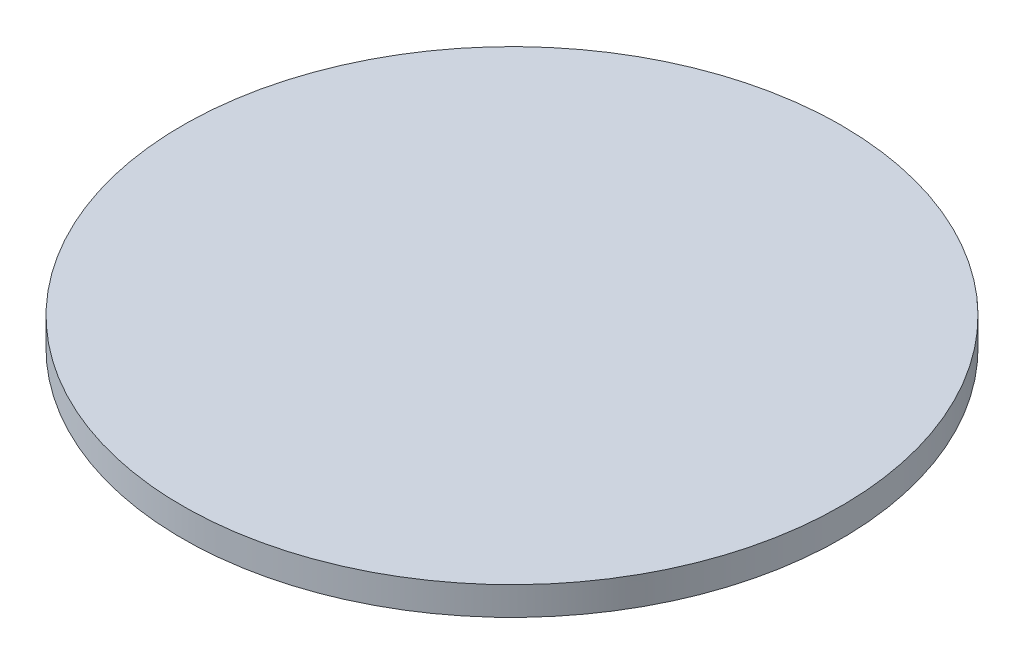
ISO-10303-21;
HEADER;
FILE_DESCRIPTION(('STEP AP214'),'2;1');
FILE_NAME('part.step','',(''),(''),'','','');
FILE_SCHEMA(('AUTOMOTIVE_DESIGN { 1 0 10303 214 1 1 1 1 }'));
ENDSEC;
DATA;
#1=APPLICATION_CONTEXT('core data for automotive mechanical design processes');
#2=APPLICATION_PROTOCOL_DEFINITION('international standard','automotive_design',2000,#1);
#3=PRODUCT_CONTEXT('',#1,'mechanical');
#4=PRODUCT('Part','Part','',(#3));
#5=PRODUCT_RELATED_PRODUCT_CATEGORY('part','',(#4));
#6=PRODUCT_DEFINITION_FORMATION('','',#4);
#7=PRODUCT_DEFINITION_CONTEXT('part definition',#1,'design');
#8=PRODUCT_DEFINITION('design','',#6,#7);
#9=PRODUCT_DEFINITION_SHAPE('','',#8);
#10=(LENGTH_UNIT() NAMED_UNIT(*) SI_UNIT(.MILLI.,.METRE.));
#11=(NAMED_UNIT(*) PLANE_ANGLE_UNIT() SI_UNIT($,.RADIAN.));
#12=(NAMED_UNIT(*) SI_UNIT($,.STERADIAN.) SOLID_ANGLE_UNIT());
#13=UNCERTAINTY_MEASURE_WITH_UNIT(LENGTH_MEASURE(1.E-05),#10,'distance_accuracy_value','');
#14=(GEOMETRIC_REPRESENTATION_CONTEXT(3) GLOBAL_UNCERTAINTY_ASSIGNED_CONTEXT((#13)) GLOBAL_UNIT_ASSIGNED_CONTEXT((#10,
#11,#12)) REPRESENTATION_CONTEXT('',''));
#15=CARTESIAN_POINT('',(0.,0.,0.));
#16=DIRECTION('',(0.,0.,1.));
#17=DIRECTION('',(1.,0.,0.));
#18=AXIS2_PLACEMENT_3D('',#15,#16,#17);
#19=CARTESIAN_POINT('',(280.194091823704,490.812576349493,565.187541491486));
#20=CARTESIAN_POINT('',(276.898103196784,490.812576349493,565.187541491486));
#21=CARTESIAN_POINT('',(270.306125942945,490.812576349493,565.511384567719));
#22=CARTESIAN_POINT('',(260.51338657893,490.812576349493,566.964000231986));
#23=CARTESIAN_POINT('',(250.91018316499,490.812576349493,569.369477463242));
#24=CARTESIAN_POINT('',(241.588999799647,490.812576349493,572.704650200784));
#25=CARTESIAN_POINT('',(232.639604574185,490.812576349493,576.937398907958));
#26=CARTESIAN_POINT('',(224.148185056863,490.812576349493,582.026959900857));
#27=CARTESIAN_POINT('',(216.196518259514,490.812576349493,587.924317924883));
#28=CARTESIAN_POINT('',(208.861183080222,490.812576349493,594.572678198442));
#29=CARTESIAN_POINT('',(202.212822806663,490.812576349493,601.908013377735));
#30=CARTESIAN_POINT('',(196.315464782636,490.812576349493,609.859680175083));
#31=CARTESIAN_POINT('',(191.225903789737,490.812576349493,618.351099692405));
#32=CARTESIAN_POINT('',(186.993155082564,490.812576349493,627.300494917867));
#33=CARTESIAN_POINT('',(183.657982345022,490.812576349493,636.62167828321));
#34=CARTESIAN_POINT('',(181.252505113766,490.812576349493,646.22488169715));
#35=CARTESIAN_POINT('',(179.799889449499,490.812576349493,656.017621061165));
#36=CARTESIAN_POINT('',(179.314124835149,490.812576349493,665.905586941924));
#37=CARTESIAN_POINT('',(179.799889449499,490.812576349493,675.793552822682));
#38=CARTESIAN_POINT('',(181.252505113765,490.812576349493,685.586292186697));
#39=CARTESIAN_POINT('',(183.657982345022,490.812576349493,695.189495600637));
#40=CARTESIAN_POINT('',(186.993155082564,490.812576349493,704.510678965981));
#41=CARTESIAN_POINT('',(191.225903789737,490.812576349493,713.460074191443));
#42=CARTESIAN_POINT('',(196.315464782637,490.812576349493,721.951493708765));
#43=CARTESIAN_POINT('',(202.212822806663,490.812576349493,729.903160506113));
#44=CARTESIAN_POINT('',(208.861183080222,490.812576349493,737.238495685406));
#45=CARTESIAN_POINT('',(216.196518259514,490.812576349493,743.886855958964));
#46=CARTESIAN_POINT('',(224.148185056863,490.812576349493,749.784213982991));
#47=CARTESIAN_POINT('',(232.639604574185,490.812576349493,754.87377497589));
#48=CARTESIAN_POINT('',(241.588999799647,490.812576349493,759.106523683064));
#49=CARTESIAN_POINT('',(250.91018316499,490.812576349493,762.441696420605));
#50=CARTESIAN_POINT('',(260.51338657893,490.812576349493,764.847173651862));
#51=CARTESIAN_POINT('',(270.306125942945,490.812576349493,766.299789316129));
#52=CARTESIAN_POINT('',(280.194091823704,490.812576349493,766.785553930478));
#53=CARTESIAN_POINT('',(290.082057704462,490.812576349493,766.299789316129));
#54=CARTESIAN_POINT('',(299.874797068477,490.812576349493,764.847173651862));
#55=CARTESIAN_POINT('',(309.478000482417,490.812576349493,762.441696420605));
#56=CARTESIAN_POINT('',(318.799183847761,490.812576349493,759.106523683064));
#57=CARTESIAN_POINT('',(327.748579073222,490.812576349493,754.87377497589));
#58=CARTESIAN_POINT('',(336.239998590545,490.812576349493,749.784213982991));
#59=CARTESIAN_POINT('',(344.191665387893,490.812576349493,743.886855958964));
#60=CARTESIAN_POINT('',(351.527000567185,490.812576349493,737.238495685406));
#61=CARTESIAN_POINT('',(358.175360840744,490.812576349493,729.903160506113));
#62=CARTESIAN_POINT('',(364.072718864771,490.812576349493,721.951493708765));
#63=CARTESIAN_POINT('',(369.16227985767,490.812576349493,713.460074191443));
#64=CARTESIAN_POINT('',(373.395028564843,490.812576349493,704.510678965981));
#65=CARTESIAN_POINT('',(376.730201302385,490.812576349492,695.189495600637));
#66=CARTESIAN_POINT('',(379.135678533642,490.812576349493,685.586292186698));
#67=CARTESIAN_POINT('',(380.588294197909,490.812576349493,675.793552822682));
#68=CARTESIAN_POINT('',(381.074058812258,490.812576349493,665.905586941924));
#69=CARTESIAN_POINT('',(380.588294197908,490.812576349493,656.017621061165));
#70=CARTESIAN_POINT('',(379.135678533642,490.812576349493,646.22488169715));
#71=CARTESIAN_POINT('',(376.730201302385,490.812576349493,636.62167828321));
#72=CARTESIAN_POINT('',(373.395028564843,490.812576349493,627.300494917867));
#73=CARTESIAN_POINT('',(369.16227985767,490.812576349493,618.351099692405));
#74=CARTESIAN_POINT('',(364.072718864771,490.812576349493,609.859680175083));
#75=CARTESIAN_POINT('',(358.175360840744,490.812576349493,601.908013377735));
#76=CARTESIAN_POINT('',(351.527000567186,490.812576349493,594.572678198442));
#77=CARTESIAN_POINT('',(344.191665387893,490.812576349492,587.924317924883));
#78=CARTESIAN_POINT('',(336.239998590545,490.812576349493,582.026959900857));
#79=CARTESIAN_POINT('',(327.748579073223,490.812576349493,576.937398907957));
#80=CARTESIAN_POINT('',(318.799183847761,490.812576349493,572.704650200784));
#81=CARTESIAN_POINT('',(309.478000482417,490.812576349493,569.369477463242));
#82=CARTESIAN_POINT('',(299.874797068477,490.812576349493,566.964000231986));
#83=CARTESIAN_POINT('',(290.082057704462,490.812576349493,565.511384567719));
#84=CARTESIAN_POINT('',(283.490080450623,490.812576349493,565.187541491486));
#85=CARTESIAN_POINT('',(280.194091823704,490.812576349493,565.187541491486));
#86=B_SPLINE_CURVE_WITH_KNOTS('',3,(#19,#20,#21,#22,#23,#24,#25,#26,#27,#28,#29,#30,#31,#32,#33,
#34,#35,#36,#37,#38,#39,#40,#41,#42,#43,#44,#45,#46,#47,#48,#49,#50,#51,#52,#53,#54,#55,#56,#57,
#58,#59,#60,#61,#62,#63,#64,#65,#66,#67,#68,#69,#70,#71,#72,#73,#74,#75,#76,#77,#78,#79,#80,#81,
#82,#83,#84,#85),.UNSPECIFIED.,.T.,.F.,(4,1,1,1,1,1,1,1,1,1,1,1,1,1,1,1,1,1,1,1,1,1,1,1,1,1,1,1,
1,1,1,1,1,1,1,1,1,1,1,1,1,1,1,1,1,1,1,1,1,1,1,1,1,1,1,1,1,1,1,1,1,1,1,1,4),(0.,0.015625,0.03125,
0.046875,0.0625,0.078125,0.09375,0.109375,0.125,0.140625,0.15625,0.171875,0.1875,0.203125,
0.21875,0.234375,0.25,0.265625,0.28125,0.296875,0.3125,0.328125,0.34375,0.359375,0.375,0.390625,
0.40625,0.421875,0.4375,0.453125,0.46875,0.484375,0.5,0.515625,0.53125,0.546875,0.5625,0.578125,
0.59375,0.609375,0.625,0.640625,0.65625,0.671875,0.6875,0.703125,0.71875,0.734375,0.75,0.765625,
0.78125,0.796875,0.8125,0.828125,0.84375,0.859375,0.875,0.890625,0.90625,0.921875,0.9375,
0.953125,0.96875,0.984375,1.),.UNSPECIFIED.);
#87=DIRECTION('',(0.,-1.,0.));
#88=VECTOR('',#87,1.);
#89=SURFACE_OF_LINEAR_EXTRUSION('',#86,#88);
#90=CARTESIAN_POINT('',(280.194091823704,490.812576349493,565.187541491486));
#91=CARTESIAN_POINT('',(281.842086137163,490.812576349493,565.187541491486));
#92=CARTESIAN_POINT('',(283.490080450623,490.812576349493,565.228021876015));
#93=CARTESIAN_POINT('',(286.782101306012,490.812576349493,565.389748490016));
#94=CARTESIAN_POINT('',(288.42612784794,490.812576349493,565.510994719487));
#95=CARTESIAN_POINT('',(291.706245388736,490.812576349493,565.834058099256));
#96=CARTESIAN_POINT('',(293.342336387603,490.812576349493,566.035875249554));
#97=CARTESIAN_POINT('',(296.602653282552,490.812576349493,566.519497575855));
#98=CARTESIAN_POINT('',(298.226879178635,490.812576349493,566.801302751857));
#99=CARTESIAN_POINT('',(301.459536308294,490.812576349493,567.444318234444));
#100=CARTESIAN_POINT('',(303.067967541871,490.812576349492,567.805528541029));
#101=CARTESIAN_POINT('',(306.265181842412,490.812576349493,568.606389032252));
#102=CARTESIAN_POINT('',(307.853964909377,490.812576349493,569.04603921689));
#103=CARTESIAN_POINT('',(311.008029372591,490.812576349493,570.00281421169));
#104=CARTESIAN_POINT('',(312.57331076884,490.812576349493,570.519939021852));
#105=CARTESIAN_POINT('',(315.676631553484,490.812576349492,571.630324953671));
#106=CARTESIAN_POINT('',(317.21467094188,490.812576349493,572.22358607533));
#107=CARTESIAN_POINT('',(320.259767373681,490.812576349493,573.484906316116));
#108=CARTESIAN_POINT('',(321.766824417086,490.812576349493,574.152965435243));
#109=CARTESIAN_POINT('',(324.746365010229,490.812576349493,575.562183184138));
#110=CARTESIAN_POINT('',(326.218848559967,490.812576349493,576.303341813906));
#111=CARTESIAN_POINT('',(329.125651017098,490.812576349493,577.857060097251));
#112=CARTESIAN_POINT('',(330.559969924491,490.812576349493,578.669619750829));
#113=CARTESIAN_POINT('',(333.387035721439,490.812576349493,580.364097779521));
#114=CARTESIAN_POINT('',(334.779782610993,490.812576349493,581.246016154634));
#115=CARTESIAN_POINT('',(337.520296996772,490.812576349493,583.077169324122));
#116=CARTESIAN_POINT('',(338.868064492995,490.812576349493,584.026404118496));
#117=CARTESIAN_POINT('',(341.515429304691,490.812576349493,585.989823677272));
#118=CARTESIAN_POINT('',(342.815026620164,490.812576349493,587.004008441673));
#119=CARTESIAN_POINT('',(345.362860282937,490.812576349493,589.094961491271));
#120=CARTESIAN_POINT('',(346.611096630238,490.812576349493,590.171729776467));
#121=CARTESIAN_POINT('',(349.053264886349,490.812576349493,592.385182061661));
#122=CARTESIAN_POINT('',(350.247196795159,490.812576349493,593.52186606166));
#123=CARTESIAN_POINT('',(352.577812703968,490.812576349493,595.852481970469));
#124=CARTESIAN_POINT('',(353.714496703966,490.812576349493,597.046413879279));
#125=CARTESIAN_POINT('',(355.927948989161,490.812576349493,599.48858213539));
#126=CARTESIAN_POINT('',(357.004717274357,490.812576349493,600.736818482691));
#127=CARTESIAN_POINT('',(359.095670323954,490.812576349493,603.284652145464));
#128=CARTESIAN_POINT('',(360.109855088356,490.812576349493,604.584249460936));
#129=CARTESIAN_POINT('',(362.073274647132,490.812576349492,607.231614272632));
#130=CARTESIAN_POINT('',(363.022509441506,490.812576349492,608.579381768856));
#131=CARTESIAN_POINT('',(364.853662610993,490.812576349493,611.319896154634));
#132=CARTESIAN_POINT('',(365.735580986107,490.812576349493,612.712643044189));
#133=CARTESIAN_POINT('',(367.430059014798,490.812576349493,615.539708841137));
#134=CARTESIAN_POINT('',(368.242618668376,490.812576349493,616.97402774853));
#135=CARTESIAN_POINT('',(369.796336951722,490.812576349493,619.88083020566));
#136=CARTESIAN_POINT('',(370.537495581489,490.812576349493,621.353313755398));
#137=CARTESIAN_POINT('',(371.946713330384,490.812576349493,624.332854348541));
#138=CARTESIAN_POINT('',(372.614772449512,490.812576349493,625.839911391947));
#139=CARTESIAN_POINT('',(373.876092690298,490.812576349493,628.885007823748));
#140=CARTESIAN_POINT('',(374.469353811956,490.812576349493,630.423047212143));
#141=CARTESIAN_POINT('',(375.579739743776,490.812576349493,633.526367996788));
#142=CARTESIAN_POINT('',(376.096864553938,490.812576349493,635.091649393036));
#143=CARTESIAN_POINT('',(377.053639548737,490.812576349493,638.24571385625));
#144=CARTESIAN_POINT('',(377.493289733375,490.812576349493,639.834496923215));
#145=CARTESIAN_POINT('',(378.294150224598,490.812576349493,643.031711223757));
#146=CARTESIAN_POINT('',(378.655360531183,490.812576349493,644.640142457333));
#147=CARTESIAN_POINT('',(379.29837601377,490.812576349493,647.872799586993));
#148=CARTESIAN_POINT('',(379.580181189773,490.812576349493,649.497025483075));
#149=CARTESIAN_POINT('',(380.063803516073,490.812576349493,652.757342378025));
#150=CARTESIAN_POINT('',(380.265620666371,490.812576349493,654.393433376891));
#151=CARTESIAN_POINT('',(380.58868404614,490.812576349493,657.673550917687));
#152=CARTESIAN_POINT('',(380.709930275612,490.812576349493,659.317577459616));
#153=CARTESIAN_POINT('',(380.871656889612,490.812576349493,662.609598315004));
#154=CARTESIAN_POINT('',(380.912137274142,490.812576349493,664.257592628464));
#155=CARTESIAN_POINT('',(380.912137274142,490.812576349493,667.553581255384));
#156=CARTESIAN_POINT('',(380.871656889612,490.812576349493,669.201575568844));
#157=CARTESIAN_POINT('',(380.709930275612,490.812576349493,672.493596424232));
#158=CARTESIAN_POINT('',(380.58868404614,490.812576349493,674.137622966161));
#159=CARTESIAN_POINT('',(380.265620666371,490.812576349493,677.417740506956));
#160=CARTESIAN_POINT('',(380.063803516073,490.812576349493,679.053831505823));
#161=CARTESIAN_POINT('',(379.580181189773,490.812576349493,682.314148400773));
#162=CARTESIAN_POINT('',(379.29837601377,490.812576349493,683.938374296855));
#163=CARTESIAN_POINT('',(378.655360531183,490.812576349493,687.171031426515));
#164=CARTESIAN_POINT('',(378.294150224598,490.812576349493,688.779462660091));
#165=CARTESIAN_POINT('',(377.493289733375,490.812576349492,691.976676960633));
#166=CARTESIAN_POINT('',(377.053639548737,490.812576349492,693.565460027598));
#167=CARTESIAN_POINT('',(376.096864553938,490.812576349492,696.719524490812));
#168=CARTESIAN_POINT('',(375.579739743776,490.812576349492,698.28480588706));
#169=CARTESIAN_POINT('',(374.469353811956,490.812576349493,701.388126671705));
#170=CARTESIAN_POINT('',(373.876092690298,490.812576349493,702.9261660601));
#171=CARTESIAN_POINT('',(372.614772449512,490.812576349493,705.971262491901));
#172=CARTESIAN_POINT('',(371.946713330384,490.812576349493,707.478319535306));
#173=CARTESIAN_POINT('',(370.537495581489,490.812576349493,710.45786012845));
#174=CARTESIAN_POINT('',(369.796336951722,490.812576349493,711.930343678188));
#175=CARTESIAN_POINT('',(368.242618668376,490.812576349493,714.837146135318));
#176=CARTESIAN_POINT('',(367.430059014798,490.812576349493,716.271465042711));
#177=CARTESIAN_POINT('',(365.735580986107,490.812576349493,719.098530839659));
#178=CARTESIAN_POINT('',(364.853662610993,490.812576349493,720.491277729213));
#179=CARTESIAN_POINT('',(363.022509441506,490.812576349493,723.231792114992));
#180=CARTESIAN_POINT('',(362.073274647131,490.812576349493,724.579559611215));
#181=CARTESIAN_POINT('',(360.109855088356,490.812576349493,727.226924422911));
#182=CARTESIAN_POINT('',(359.095670323954,490.812576349493,728.526521738384));
#183=CARTESIAN_POINT('',(357.004717274357,490.812576349493,731.074355401158));
#184=CARTESIAN_POINT('',(355.927948989161,490.812576349493,732.322591748459));
#185=CARTESIAN_POINT('',(353.714496703966,490.812576349493,734.764760004569));
#186=CARTESIAN_POINT('',(352.577812703967,490.812576349493,735.958691913379));
#187=CARTESIAN_POINT('',(350.247196795159,490.812576349493,738.289307822188));
#188=CARTESIAN_POINT('',(349.053264886349,490.812576349493,739.425991822186));
#189=CARTESIAN_POINT('',(346.611096630238,490.812576349493,741.639444107381));
#190=CARTESIAN_POINT('',(345.362860282937,490.812576349493,742.716212392577));
#191=CARTESIAN_POINT('',(342.815026620163,490.812576349493,744.807165442175));
#192=CARTESIAN_POINT('',(341.515429304691,490.812576349493,745.821350206576));
#193=CARTESIAN_POINT('',(338.868064492995,490.812576349493,747.784769765352));
#194=CARTESIAN_POINT('',(337.520296996771,490.812576349493,748.734004559726));
#195=CARTESIAN_POINT('',(334.779782610993,490.812576349493,750.565157729214));
#196=CARTESIAN_POINT('',(333.387035721438,490.812576349493,751.447076104327));
#197=CARTESIAN_POINT('',(330.559969924491,490.812576349493,753.141554133018));
#198=CARTESIAN_POINT('',(329.125651017098,490.812576349493,753.954113786596));
#199=CARTESIAN_POINT('',(326.218848559967,490.812576349493,755.507832069942));
#200=CARTESIAN_POINT('',(324.746365010229,490.812576349493,756.24899069971));
#201=CARTESIAN_POINT('',(321.766824417086,490.812576349493,757.658208448605));
#202=CARTESIAN_POINT('',(320.259767373681,490.812576349493,758.326267567732));
#203=CARTESIAN_POINT('',(317.21467094188,490.812576349493,759.587587808518));
#204=CARTESIAN_POINT('',(315.676631553484,490.812576349493,760.180848930176));
#205=CARTESIAN_POINT('',(312.57331076884,490.812576349493,761.291234861996));
#206=CARTESIAN_POINT('',(311.008029372591,490.812576349493,761.808359672158));
#207=CARTESIAN_POINT('',(307.853964909377,490.812576349493,762.765134666958));
#208=CARTESIAN_POINT('',(306.265181842412,490.812576349493,763.204784851596));
#209=CARTESIAN_POINT('',(303.067967541871,490.812576349493,764.005645342819));
#210=CARTESIAN_POINT('',(301.459536308294,490.812576349493,764.366855649403));
#211=CARTESIAN_POINT('',(298.226879178635,490.812576349493,765.009871131991));
#212=CARTESIAN_POINT('',(296.602653282552,490.812576349493,765.291676307993));
#213=CARTESIAN_POINT('',(293.342336387603,490.812576349493,765.775298634293));
#214=CARTESIAN_POINT('',(291.706245388736,490.812576349493,765.977115784591));
#215=CARTESIAN_POINT('',(288.42612784794,490.812576349493,766.300179164361));
#216=CARTESIAN_POINT('',(286.782101306012,490.812576349493,766.421425393832));
#217=CARTESIAN_POINT('',(283.490080450623,490.812576349493,766.583152007833));
#218=CARTESIAN_POINT('',(281.842086137163,490.812576349493,766.623632392362));
#219=CARTESIAN_POINT('',(278.546097510244,490.812576349493,766.623632392362));
#220=CARTESIAN_POINT('',(276.898103196784,490.812576349493,766.583152007833));
#221=CARTESIAN_POINT('',(273.606082341395,490.812576349493,766.421425393832));
#222=CARTESIAN_POINT('',(271.962055799467,490.812576349493,766.300179164361));
#223=CARTESIAN_POINT('',(268.681938258671,490.812576349493,765.977115784591));
#224=CARTESIAN_POINT('',(267.045847259804,490.812576349493,765.775298634293));
#225=CARTESIAN_POINT('',(263.785530364855,490.812576349493,765.291676307993));
#226=CARTESIAN_POINT('',(262.161304468772,490.812576349493,765.00987113199));
#227=CARTESIAN_POINT('',(258.928647339113,490.812576349493,764.366855649403));
#228=CARTESIAN_POINT('',(257.320216105537,490.812576349493,764.005645342818));
#229=CARTESIAN_POINT('',(254.123001804995,490.812576349493,763.204784851595));
#230=CARTESIAN_POINT('',(252.53421873803,490.812576349493,762.765134666957));
#231=CARTESIAN_POINT('',(249.380154274816,490.812576349493,761.808359672158));
#232=CARTESIAN_POINT('',(247.814872878567,490.812576349493,761.291234861996));
#233=CARTESIAN_POINT('',(244.711552093923,490.812576349493,760.180848930176));
#234=CARTESIAN_POINT('',(243.173512705527,490.812576349493,759.587587808518));
#235=CARTESIAN_POINT('',(240.128416273726,490.812576349493,758.326267567732));
#236=CARTESIAN_POINT('',(238.621359230321,490.812576349493,757.658208448604));
#237=CARTESIAN_POINT('',(235.641818637178,490.812576349493,756.24899069971));
#238=CARTESIAN_POINT('',(234.16933508744,490.812576349493,755.507832069942));
#239=CARTESIAN_POINT('',(231.262532630309,490.812576349493,753.954113786597));
#240=CARTESIAN_POINT('',(229.828213722916,490.812576349493,753.141554133019));
#241=CARTESIAN_POINT('',(227.001147925969,490.812576349493,751.447076104327));
#242=CARTESIAN_POINT('',(225.608401036414,490.812576349493,750.565157729214));
#243=CARTESIAN_POINT('',(222.867886650636,490.812576349493,748.734004559726));
#244=CARTESIAN_POINT('',(221.520119154412,490.812576349493,747.784769765352));
#245=CARTESIAN_POINT('',(218.872754342716,490.812576349493,745.821350206576));
#246=CARTESIAN_POINT('',(217.573157027244,490.812576349493,744.807165442174));
#247=CARTESIAN_POINT('',(215.02532336447,490.812576349493,742.716212392577));
#248=CARTESIAN_POINT('',(213.777087017169,490.812576349493,741.639444107381));
#249=CARTESIAN_POINT('',(211.334918761058,490.812576349493,739.425991822186));
#250=CARTESIAN_POINT('',(210.140986852248,490.812576349493,738.289307822188));
#251=CARTESIAN_POINT('',(207.81037094344,490.812576349493,735.958691913379));
#252=CARTESIAN_POINT('',(206.673686943441,490.812576349493,734.764760004569));
#253=CARTESIAN_POINT('',(204.460234658246,490.812576349493,732.322591748458));
#254=CARTESIAN_POINT('',(203.38346637305,490.812576349493,731.074355401157));
#255=CARTESIAN_POINT('',(201.292513323453,490.812576349493,728.526521738384));
#256=CARTESIAN_POINT('',(200.278328559051,490.812576349493,727.226924422911));
#257=CARTESIAN_POINT('',(198.314909000276,490.812576349493,724.579559611215));
#258=CARTESIAN_POINT('',(197.365674205902,490.812576349493,723.231792114992));
#259=CARTESIAN_POINT('',(195.534521036414,490.812576349493,720.491277729213));
#260=CARTESIAN_POINT('',(194.6526026613,490.812576349493,719.098530839658));
#261=CARTESIAN_POINT('',(192.958124632609,490.812576349493,716.271465042711));
#262=CARTESIAN_POINT('',(192.145564979031,490.812576349493,714.837146135318));
#263=CARTESIAN_POINT('',(190.591846695685,490.812576349493,711.930343678187));
#264=CARTESIAN_POINT('',(189.850688065918,490.812576349493,710.45786012845));
#265=CARTESIAN_POINT('',(188.441470317023,490.812576349493,707.478319535306));
#266=CARTESIAN_POINT('',(187.773411197895,490.812576349493,705.971262491901));
#267=CARTESIAN_POINT('',(186.512090957109,490.812576349493,702.9261660601));
#268=CARTESIAN_POINT('',(185.918829835451,490.812576349493,701.388126671705));
#269=CARTESIAN_POINT('',(184.808443903631,490.812576349493,698.28480588706));
#270=CARTESIAN_POINT('',(184.291319093469,490.812576349493,696.719524490811));
#271=CARTESIAN_POINT('',(183.33454409867,490.812576349493,693.565460027597));
#272=CARTESIAN_POINT('',(182.894893914032,490.812576349493,691.976676960632));
#273=CARTESIAN_POINT('',(182.094033422809,490.812576349493,688.779462660091));
#274=CARTESIAN_POINT('',(181.732823116224,490.812576349493,687.171031426514));
#275=CARTESIAN_POINT('',(181.089807633637,490.812576349493,683.938374296855));
#276=CARTESIAN_POINT('',(180.808002457634,490.812576349493,682.314148400772));
#277=CARTESIAN_POINT('',(180.324380131334,490.812576349493,679.053831505823));
#278=CARTESIAN_POINT('',(180.122562981036,490.812576349493,677.417740506956));
#279=CARTESIAN_POINT('',(179.799499601267,490.812576349493,674.137622966161));
#280=CARTESIAN_POINT('',(179.678253371795,490.812576349493,672.493596424232));
#281=CARTESIAN_POINT('',(179.516526757795,490.812576349493,669.201575568843));
#282=CARTESIAN_POINT('',(179.476046373266,490.812576349493,667.553581255384));
#283=CARTESIAN_POINT('',(179.476046373266,490.812576349493,664.257592628464));
#284=CARTESIAN_POINT('',(179.516526757795,490.812576349493,662.609598315004));
#285=CARTESIAN_POINT('',(179.678253371795,490.812576349493,659.317577459616));
#286=CARTESIAN_POINT('',(179.799499601267,490.812576349493,657.673550917687));
#287=CARTESIAN_POINT('',(180.122562981036,490.812576349493,654.393433376891));
#288=CARTESIAN_POINT('',(180.324380131334,490.812576349493,652.757342378025));
#289=CARTESIAN_POINT('',(180.808002457634,490.812576349493,649.497025483075));
#290=CARTESIAN_POINT('',(181.089807633637,490.812576349493,647.872799586993));
#291=CARTESIAN_POINT('',(181.732823116224,490.812576349493,644.640142457333));
#292=CARTESIAN_POINT('',(182.094033422809,490.812576349493,643.031711223757));
#293=CARTESIAN_POINT('',(182.894893914032,490.812576349493,639.834496923215));
#294=CARTESIAN_POINT('',(183.33454409867,490.812576349493,638.24571385625));
#295=CARTESIAN_POINT('',(184.291319093469,490.812576349493,635.091649393036));
#296=CARTESIAN_POINT('',(184.808443903631,490.812576349493,633.526367996787));
#297=CARTESIAN_POINT('',(185.918829835451,490.812576349493,630.423047212143));
#298=CARTESIAN_POINT('',(186.512090957109,490.812576349493,628.885007823748));
#299=CARTESIAN_POINT('',(187.773411197895,490.812576349493,625.839911391947));
#300=CARTESIAN_POINT('',(188.441470317023,490.812576349493,624.332854348541));
#301=CARTESIAN_POINT('',(189.850688065918,490.812576349493,621.353313755398));
#302=CARTESIAN_POINT('',(190.591846695685,490.812576349493,619.88083020566));
#303=CARTESIAN_POINT('',(192.145564979031,490.812576349493,616.974027748529));
#304=CARTESIAN_POINT('',(192.958124632609,490.812576349493,615.539708841137));
#305=CARTESIAN_POINT('',(194.6526026613,490.812576349493,612.712643044189));
#306=CARTESIAN_POINT('',(195.534521036414,490.812576349493,611.319896154634));
#307=CARTESIAN_POINT('',(197.365674205902,490.812576349493,608.579381768856));
#308=CARTESIAN_POINT('',(198.314909000276,490.812576349493,607.231614272632));
#309=CARTESIAN_POINT('',(200.278328559051,490.812576349493,604.584249460936));
#310=CARTESIAN_POINT('',(201.292513323453,490.812576349493,603.284652145464));
#311=CARTESIAN_POINT('',(203.383466373051,490.812576349493,600.73681848269));
#312=CARTESIAN_POINT('',(204.460234658246,490.812576349493,599.488582135389));
#313=CARTESIAN_POINT('',(206.673686943441,490.812576349493,597.046413879278));
#314=CARTESIAN_POINT('',(207.81037094344,490.812576349493,595.852481970468));
#315=CARTESIAN_POINT('',(210.140986852248,490.812576349493,593.52186606166));
#316=CARTESIAN_POINT('',(211.334918761058,490.812576349493,592.385182061661));
#317=CARTESIAN_POINT('',(213.777087017169,490.812576349493,590.171729776467));
#318=CARTESIAN_POINT('',(215.02532336447,490.812576349493,589.094961491271));
#319=CARTESIAN_POINT('',(217.573157027244,490.812576349493,587.004008441673));
#320=CARTESIAN_POINT('',(218.872754342716,490.812576349493,585.989823677272));
#321=CARTESIAN_POINT('',(221.520119154412,490.812576349493,584.026404118496));
#322=CARTESIAN_POINT('',(222.867886650636,490.812576349493,583.077169324122));
#323=CARTESIAN_POINT('',(225.608401036414,490.812576349493,581.246016154634));
#324=CARTESIAN_POINT('',(227.001147925969,490.812576349493,580.364097779521));
#325=CARTESIAN_POINT('',(229.828213722916,490.812576349493,578.669619750829));
#326=CARTESIAN_POINT('',(231.262532630309,490.812576349493,577.857060097251));
#327=CARTESIAN_POINT('',(234.16933508744,490.812576349493,576.303341813906));
#328=CARTESIAN_POINT('',(235.641818637178,490.812576349493,575.562183184138));
#329=CARTESIAN_POINT('',(238.621359230321,490.812576349493,574.152965435243));
#330=CARTESIAN_POINT('',(240.128416273726,490.812576349493,573.484906316116));
#331=CARTESIAN_POINT('',(243.173512705527,490.812576349493,572.22358607533));
#332=CARTESIAN_POINT('',(244.711552093923,490.812576349493,571.630324953671));
#333=CARTESIAN_POINT('',(247.814872878567,490.812576349493,570.519939021852));
#334=CARTESIAN_POINT('',(249.380154274816,490.812576349493,570.00281421169));
#335=CARTESIAN_POINT('',(252.53421873803,490.812576349493,569.04603921689));
#336=CARTESIAN_POINT('',(254.123001804995,490.812576349493,568.606389032252));
#337=CARTESIAN_POINT('',(257.320216105537,490.812576349493,567.805528541029));
#338=CARTESIAN_POINT('',(258.928647339113,490.812576349492,567.444318234444));
#339=CARTESIAN_POINT('',(262.161304468772,490.812576349493,566.801302751857));
#340=CARTESIAN_POINT('',(263.785530364855,490.812576349493,566.519497575855));
#341=CARTESIAN_POINT('',(267.045847259804,490.812576349493,566.035875249554));
#342=CARTESIAN_POINT('',(268.681938258671,490.812576349493,565.834058099257));
#343=CARTESIAN_POINT('',(271.962055799467,490.812576349493,565.510994719487));
#344=CARTESIAN_POINT('',(273.606082341396,490.812576349493,565.389748490016));
#345=CARTESIAN_POINT('',(276.898103196784,490.812576349493,565.228021876015));
#346=CARTESIAN_POINT('',(278.546097510244,490.812576349493,565.187541491486));
#347=CARTESIAN_POINT('',(280.194091823704,490.812576349493,565.187541491486));
#348=B_SPLINE_CURVE_WITH_KNOTS('',3,(#90,#91,#92,#93,#94,#95,#96,#97,#98,#99,#100,#101,#102,
#103,#104,#105,#106,#107,#108,#109,#110,#111,#112,#113,#114,#115,#116,#117,#118,#119,#120,#121,
#122,#123,#124,#125,#126,#127,#128,#129,#130,#131,#132,#133,#134,#135,#136,#137,#138,#139,#140,
#141,#142,#143,#144,#145,#146,#147,#148,#149,#150,#151,#152,#153,#154,#155,#156,#157,#158,#159,
#160,#161,#162,#163,#164,#165,#166,#167,#168,#169,#170,#171,#172,#173,#174,#175,#176,#177,#178,
#179,#180,#181,#182,#183,#184,#185,#186,#187,#188,#189,#190,#191,#192,#193,#194,#195,#196,#197,
#198,#199,#200,#201,#202,#203,#204,#205,#206,#207,#208,#209,#210,#211,#212,#213,#214,#215,#216,
#217,#218,#219,#220,#221,#222,#223,#224,#225,#226,#227,#228,#229,#230,#231,#232,#233,#234,#235,
#236,#237,#238,#239,#240,#241,#242,#243,#244,#245,#246,#247,#248,#249,#250,#251,#252,#253,#254,
#255,#256,#257,#258,#259,#260,#261,#262,#263,#264,#265,#266,#267,#268,#269,#270,#271,#272,#273,
#274,#275,#276,#277,#278,#279,#280,#281,#282,#283,#284,#285,#286,#287,#288,#289,#290,#291,#292,
#293,#294,#295,#296,#297,#298,#299,#300,#301,#302,#303,#304,#305,#306,#307,#308,#309,#310,#311,
#312,#313,#314,#315,#316,#317,#318,#319,#320,#321,#322,#323,#324,#325,#326,#327,#328,#329,#330,
#331,#332,#333,#334,#335,#336,#337,#338,#339,#340,#341,#342,#343,#344,#345,#346,#347),
.UNSPECIFIED.,.F.,.F.,(4,2,2,2,2,2,2,2,2,2,2,2,2,2,2,2,2,2,2,2,2,2,2,2,2,2,2,2,2,2,2,2,2,2,2,2,
2,2,2,2,2,2,2,2,2,2,2,2,2,2,2,2,2,2,2,2,2,2,2,2,2,2,2,2,2,2,2,2,2,2,2,2,2,2,2,2,2,2,2,2,2,2,2,2,
2,2,2,2,2,2,2,2,2,2,2,2,2,2,2,2,2,2,2,2,2,2,2,2,2,2,2,2,2,2,2,2,2,2,2,2,2,2,2,2,2,2,2,2,4),(0.,
4.94348854021899,9.88697708043816,14.8304656206572,19.7739541608764,24.7174427010956,
29.6609312413148,34.6044197815339,39.547908321753,44.4913968619721,49.4348854021912,
54.3783739424104,59.3218624826295,64.2653510228486,69.2088395630677,74.1523281032869,
79.0958166435061,84.0393051837253,88.9827937239442,93.9262822641633,98.8697708043824,
103.813259344602,108.756747884821,113.70023642504,118.643724965259,123.587213505478,
128.530702045697,133.474190585916,138.417679126136,143.361167666354,148.304656206574,
153.248144746793,158.191633287012,163.135121827231,168.07861036745,173.022098907669,
177.965587447888,182.909075988107,187.852564528327,192.796053068546,197.739541608765,
202.683030148984,207.626518689203,212.570007229422,217.513495769641,222.45698430986,
227.40047285008,232.343961390299,237.287449930518,242.230938470737,247.174427010956,
252.117915551175,257.061404091394,262.004892631613,266.948381171832,271.891869712051,
276.835358252271,281.77884679249,286.722335332709,291.665823872928,296.609312413147,
301.552800953366,306.496289493585,311.439778033804,316.383266574023,321.326755114243,
326.270243654462,331.213732194681,336.1572207349,341.100709275119,346.044197815338,
350.987686355557,355.931174895776,360.874663435995,365.818151976214,370.761640516434,
375.705129056653,380.648617596872,385.592106137091,390.53559467731,395.479083217529,
400.422571757748,405.366060297967,410.309548838187,415.253037378406,420.196525918625,
425.140014458844,430.083502999063,435.026991539282,439.970480079501,444.91396861972,
449.857457159939,454.800945700159,459.744434240378,464.687922780597,469.631411320816,
474.574899861035,479.518388401254,484.461876941473,489.405365481692,494.348854021911,
499.292342562131,504.23583110235,509.179319642569,514.122808182788,519.066296723007,
524.009785263226,528.953273803445,533.896762343664,538.840250883884,543.783739424103,
548.727227964322,553.670716504541,558.61420504476,563.557693584979,568.501182125198,
573.444670665417,578.388159205636,583.331647745855,588.275136286074,593.218624826294,
598.162113366513,603.105601906732,608.049090446951,612.99257898717,617.936067527389,
622.879556067608,627.823044607827,632.766533148046),.UNSPECIFIED.);
#349=CARTESIAN_POINT('',(280.194091823704,490.812576349493,565.187541491486));
#350=VERTEX_POINT('',#349);
#351=EDGE_CURVE('E9',#350,#350,#348,.F.);
#352=ORIENTED_EDGE('',*,*,#351,.F.);
#353=EDGE_LOOP('',(#352));
#354=FACE_BOUND('',#353,.T.);
#355=CARTESIAN_POINT('',(280.194091823704,482.136799888067,565.187541491486));
#356=CARTESIAN_POINT('',(276.898103196784,482.136799888067,565.187541491486));
#357=CARTESIAN_POINT('',(270.306125942945,482.136799888067,565.511384567719));
#358=CARTESIAN_POINT('',(260.51338657893,482.136799888067,566.964000231986));
#359=CARTESIAN_POINT('',(250.91018316499,482.136799888067,569.369477463242));
#360=CARTESIAN_POINT('',(241.588999799647,482.136799888068,572.704650200784));
#361=CARTESIAN_POINT('',(232.639604574185,482.136799888067,576.937398907958));
#362=CARTESIAN_POINT('',(224.148185056863,482.136799888067,582.026959900857));
#363=CARTESIAN_POINT('',(216.196518259514,482.136799888067,587.924317924883));
#364=CARTESIAN_POINT('',(208.861183080222,482.136799888067,594.572678198442));
#365=CARTESIAN_POINT('',(202.212822806663,482.136799888067,601.908013377735));
#366=CARTESIAN_POINT('',(196.315464782636,482.136799888067,609.859680175083));
#367=CARTESIAN_POINT('',(191.225903789737,482.136799888067,618.351099692405));
#368=CARTESIAN_POINT('',(186.993155082564,482.136799888067,627.300494917867));
#369=CARTESIAN_POINT('',(183.657982345022,482.136799888067,636.62167828321));
#370=CARTESIAN_POINT('',(181.252505113766,482.136799888067,646.22488169715));
#371=CARTESIAN_POINT('',(179.799889449499,482.136799888067,656.017621061165));
#372=CARTESIAN_POINT('',(179.314124835149,482.136799888067,665.905586941924));
#373=CARTESIAN_POINT('',(179.799889449499,482.136799888067,675.793552822682));
#374=CARTESIAN_POINT('',(181.252505113765,482.136799888067,685.586292186697));
#375=CARTESIAN_POINT('',(183.657982345022,482.136799888067,695.189495600637));
#376=CARTESIAN_POINT('',(186.993155082564,482.136799888067,704.510678965981));
#377=CARTESIAN_POINT('',(191.225903789737,482.136799888067,713.460074191443));
#378=CARTESIAN_POINT('',(196.315464782637,482.136799888067,721.951493708765));
#379=CARTESIAN_POINT('',(202.212822806663,482.136799888067,729.903160506113));
#380=CARTESIAN_POINT('',(208.861183080222,482.136799888067,737.238495685406));
#381=CARTESIAN_POINT('',(216.196518259514,482.136799888067,743.886855958964));
#382=CARTESIAN_POINT('',(224.148185056863,482.136799888067,749.784213982991));
#383=CARTESIAN_POINT('',(232.639604574185,482.136799888067,754.87377497589));
#384=CARTESIAN_POINT('',(241.588999799647,482.136799888067,759.106523683064));
#385=CARTESIAN_POINT('',(250.91018316499,482.136799888067,762.441696420605));
#386=CARTESIAN_POINT('',(260.51338657893,482.136799888067,764.847173651862));
#387=CARTESIAN_POINT('',(270.306125942945,482.136799888067,766.299789316129));
#388=CARTESIAN_POINT('',(280.194091823704,482.136799888067,766.785553930478));
#389=CARTESIAN_POINT('',(290.082057704462,482.136799888067,766.299789316129));
#390=CARTESIAN_POINT('',(299.874797068477,482.136799888067,764.847173651862));
#391=CARTESIAN_POINT('',(309.478000482417,482.136799888067,762.441696420605));
#392=CARTESIAN_POINT('',(318.799183847761,482.136799888067,759.106523683064));
#393=CARTESIAN_POINT('',(327.748579073222,482.136799888067,754.87377497589));
#394=CARTESIAN_POINT('',(336.239998590545,482.136799888067,749.784213982991));
#395=CARTESIAN_POINT('',(344.191665387893,482.136799888067,743.886855958964));
#396=CARTESIAN_POINT('',(351.527000567185,482.136799888067,737.238495685406));
#397=CARTESIAN_POINT('',(358.175360840744,482.136799888067,729.903160506113));
#398=CARTESIAN_POINT('',(364.072718864771,482.136799888067,721.951493708765));
#399=CARTESIAN_POINT('',(369.16227985767,482.136799888067,713.460074191443));
#400=CARTESIAN_POINT('',(373.395028564843,482.136799888068,704.510678965981));
#401=CARTESIAN_POINT('',(376.730201302385,482.136799888067,695.189495600637));
#402=CARTESIAN_POINT('',(379.135678533642,482.136799888067,685.586292186698));
#403=CARTESIAN_POINT('',(380.588294197909,482.136799888067,675.793552822682));
#404=CARTESIAN_POINT('',(381.074058812258,482.136799888067,665.905586941924));
#405=CARTESIAN_POINT('',(380.588294197908,482.136799888067,656.017621061165));
#406=CARTESIAN_POINT('',(379.135678533642,482.136799888067,646.22488169715));
#407=CARTESIAN_POINT('',(376.730201302385,482.136799888067,636.62167828321));
#408=CARTESIAN_POINT('',(373.395028564843,482.136799888067,627.300494917867));
#409=CARTESIAN_POINT('',(369.16227985767,482.136799888067,618.351099692405));
#410=CARTESIAN_POINT('',(364.072718864771,482.136799888067,609.859680175083));
#411=CARTESIAN_POINT('',(358.175360840744,482.136799888067,601.908013377735));
#412=CARTESIAN_POINT('',(351.527000567186,482.136799888068,594.572678198442));
#413=CARTESIAN_POINT('',(344.191665387893,482.136799888067,587.924317924883));
#414=CARTESIAN_POINT('',(336.239998590545,482.136799888067,582.026959900857));
#415=CARTESIAN_POINT('',(327.748579073223,482.136799888067,576.937398907957));
#416=CARTESIAN_POINT('',(318.799183847761,482.136799888067,572.704650200784));
#417=CARTESIAN_POINT('',(309.478000482417,482.136799888067,569.369477463242));
#418=CARTESIAN_POINT('',(299.874797068477,482.136799888067,566.964000231986));
#419=CARTESIAN_POINT('',(290.082057704462,482.136799888067,565.511384567719));
#420=CARTESIAN_POINT('',(283.490080450623,482.136799888067,565.187541491486));
#421=CARTESIAN_POINT('',(280.194091823704,482.136799888067,565.187541491486));
#422=B_SPLINE_CURVE_WITH_KNOTS('',3,(#355,#356,#357,#358,#359,#360,#361,#362,#363,#364,#365,
#366,#367,#368,#369,#370,#371,#372,#373,#374,#375,#376,#377,#378,#379,#380,#381,#382,#383,#384,
#385,#386,#387,#388,#389,#390,#391,#392,#393,#394,#395,#396,#397,#398,#399,#400,#401,#402,#403,
#404,#405,#406,#407,#408,#409,#410,#411,#412,#413,#414,#415,#416,#417,#418,#419,#420,#421),
.UNSPECIFIED.,.T.,.F.,(4,1,1,1,1,1,1,1,1,1,1,1,1,1,1,1,1,1,1,1,1,1,1,1,1,1,1,1,1,1,1,1,1,1,1,1,
1,1,1,1,1,1,1,1,1,1,1,1,1,1,1,1,1,1,1,1,1,1,1,1,1,1,1,1,4),(0.,0.015625,0.03125,0.046875,0.0625,
0.078125,0.09375,0.109375,0.125,0.140625,0.15625,0.171875,0.1875,0.203125,0.21875,0.234375,0.25,
0.265625,0.28125,0.296875,0.3125,0.328125,0.34375,0.359375,0.375,0.390625,0.40625,0.421875,
0.4375,0.453125,0.46875,0.484375,0.5,0.515625,0.53125,0.546875,0.5625,0.578125,0.59375,0.609375,
0.625,0.640625,0.65625,0.671875,0.6875,0.703125,0.71875,0.734375,0.75,0.765625,0.78125,0.796875,
0.8125,0.828125,0.84375,0.859375,0.875,0.890625,0.90625,0.921875,0.9375,0.953125,0.96875,
0.984375,1.),.UNSPECIFIED.);
#423=CARTESIAN_POINT('',(280.194091823704,482.136799888067,565.187541491486));
#424=VERTEX_POINT('',#423);
#425=EDGE_CURVE('E24',#424,#424,#422,.T.);
#426=ORIENTED_EDGE('',*,*,#425,.T.);
#427=EDGE_LOOP('',(#426));
#428=FACE_BOUND('',#427,.T.);
#429=ADVANCED_FACE('F14',(#354,#428),#89,.F.);
#430=CARTESIAN_POINT('',(280.194091823704,490.812576349493,567.958150644097));
#431=DIRECTION('',(0.,-1.,0.));
#432=DIRECTION('',(1.,0.,0.));
#433=AXIS2_PLACEMENT_3D('',#430,#431,#432);
#434=PLANE('',#433);
#435=ORIENTED_EDGE('',*,*,#351,.T.);
#436=EDGE_LOOP('',(#435));
#437=FACE_BOUND('',#436,.T.);
#438=ADVANCED_FACE('F59',(#437),#434,.F.);
#439=CARTESIAN_POINT('',(280.194091823704,482.136799888067,567.958150644097));
#440=DIRECTION('',(0.,-1.,0.));
#441=DIRECTION('',(1.,0.,0.));
#442=AXIS2_PLACEMENT_3D('',#439,#440,#441);
#443=PLANE('',#442);
#444=ORIENTED_EDGE('',*,*,#425,.F.);
#445=EDGE_LOOP('',(#444));
#446=FACE_BOUND('',#445,.T.);
#447=ADVANCED_FACE('F67',(#446),#443,.T.);
#448=CLOSED_SHELL('',(#429,#438,#447));
#449=MANIFOLD_SOLID_BREP('B1',#448);
#450=ADVANCED_BREP_SHAPE_REPRESENTATION('',(#18,#449),#14);
#451=SHAPE_DEFINITION_REPRESENTATION(#9,#450);
ENDSEC;
END-ISO-10303-21;
